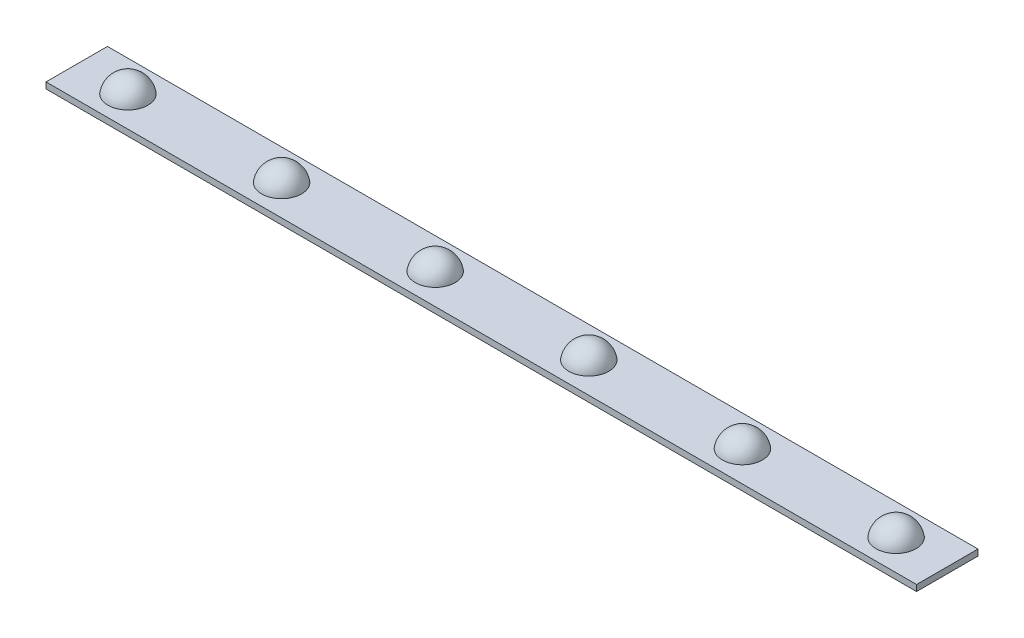
ISO-10303-21;
HEADER;
FILE_DESCRIPTION(('STEP AP214'),'2;1');
FILE_NAME('part.step','',(''),(''),'','','');
FILE_SCHEMA(('AUTOMOTIVE_DESIGN { 1 0 10303 214 1 1 1 1 }'));
ENDSEC;
DATA;
#1=APPLICATION_CONTEXT('core data for automotive mechanical design processes');
#2=APPLICATION_PROTOCOL_DEFINITION('international standard','automotive_design',2000,#1);
#3=PRODUCT_CONTEXT('',#1,'mechanical');
#4=PRODUCT('Part','Part','',(#3));
#5=PRODUCT_RELATED_PRODUCT_CATEGORY('part','',(#4));
#6=PRODUCT_DEFINITION_FORMATION('','',#4);
#7=PRODUCT_DEFINITION_CONTEXT('part definition',#1,'design');
#8=PRODUCT_DEFINITION('design','',#6,#7);
#9=PRODUCT_DEFINITION_SHAPE('','',#8);
#10=(LENGTH_UNIT() NAMED_UNIT(*) SI_UNIT(.MILLI.,.METRE.));
#11=(NAMED_UNIT(*) PLANE_ANGLE_UNIT() SI_UNIT($,.RADIAN.));
#12=(NAMED_UNIT(*) SI_UNIT($,.STERADIAN.) SOLID_ANGLE_UNIT());
#13=UNCERTAINTY_MEASURE_WITH_UNIT(LENGTH_MEASURE(1.E-05),#10,'distance_accuracy_value','');
#14=(GEOMETRIC_REPRESENTATION_CONTEXT(3) GLOBAL_UNCERTAINTY_ASSIGNED_CONTEXT((#13)) GLOBAL_UNIT_ASSIGNED_CONTEXT((#10,
#11,#12)) REPRESENTATION_CONTEXT('',''));
#15=CARTESIAN_POINT('',(0.,0.,0.));
#16=DIRECTION('',(0.,0.,1.));
#17=DIRECTION('',(1.,0.,0.));
#18=AXIS2_PLACEMENT_3D('',#15,#16,#17);
#19=CARTESIAN_POINT('',(-142.113,19.1743717494883,0.152400000000004));
#20=DIRECTION('',(0.,0.,1.));
#21=DIRECTION('',(0.990879797817192,0.134748752416344,0.));
#22=AXIS2_PLACEMENT_3D('',#19,#20,#21);
#23=SPHERICAL_SURFACE('',#22,2.50880067106193);
#24=CARTESIAN_POINT('',(-142.113,19.1743717494883,0.152400000000004));
#25=DIRECTION('',(0.,-1.,0.));
#26=DIRECTION('',(0.,0.,-1.));
#27=AXIS2_PLACEMENT_3D('',#24,#25,#26);
#28=SPHERICAL_SURFACE('',#27,2.50880067106193);
#29=CARTESIAN_POINT('',(-142.113,19.5553717494883,0.152400000000004));
#30=DIRECTION('',(0.,-1.,0.));
#31=DIRECTION('',(0.,0.,-1.));
#32=AXIS2_PLACEMENT_3D('',#29,#30,#31);
#33=CIRCLE('',#32,2.47970155605887);
#34=CARTESIAN_POINT('',(-142.113,19.5553717494883,-2.32730155605887));
#35=VERTEX_POINT('',#34);
#36=EDGE_CURVE('E21',#35,#35,#33,.F.);
#37=ORIENTED_EDGE('',*,*,#36,.T.);
#38=EDGE_LOOP('',(#37));
#39=FACE_BOUND('',#38,.T.);
#40=ADVANCED_FACE('F17',(#39),#28,.T.);
#41=CARTESIAN_POINT('',(-161.163,19.1743717494883,0.152399999999993));
#42=DIRECTION('',(0.,0.,1.));
#43=DIRECTION('',(0.990879797817191,0.134748752416346,0.));
#44=AXIS2_PLACEMENT_3D('',#41,#42,#43);
#45=SPHERICAL_SURFACE('',#44,2.50880067106193);
#46=CARTESIAN_POINT('',(-161.163,19.1743717494883,0.152399999999993));
#47=DIRECTION('',(0.,-1.,0.));
#48=DIRECTION('',(0.,0.,-1.));
#49=AXIS2_PLACEMENT_3D('',#46,#47,#48);
#50=SPHERICAL_SURFACE('',#49,2.50880067106193);
#51=CARTESIAN_POINT('',(-161.163,19.5553717494883,0.152399999999993));
#52=DIRECTION('',(0.,-1.,0.));
#53=DIRECTION('',(0.,0.,-1.));
#54=AXIS2_PLACEMENT_3D('',#51,#52,#53);
#55=CIRCLE('',#54,2.47970155605887);
#56=CARTESIAN_POINT('',(-161.163,19.5553717494883,-2.32730155605888));
#57=VERTEX_POINT('',#56);
#58=EDGE_CURVE('E112',#57,#57,#55,.F.);
#59=ORIENTED_EDGE('',*,*,#58,.T.);
#60=EDGE_LOOP('',(#59));
#61=FACE_BOUND('',#60,.T.);
#62=ADVANCED_FACE('F285',(#61),#50,.T.);
#63=CARTESIAN_POINT('',(-180.213,19.1743717494883,0.152399999999994));
#64=DIRECTION('',(0.,0.,1.));
#65=DIRECTION('',(0.990879797817191,0.134748752416346,0.));
#66=AXIS2_PLACEMENT_3D('',#63,#64,#65);
#67=SPHERICAL_SURFACE('',#66,2.50880067106193);
#68=CARTESIAN_POINT('',(-180.213,19.1743717494883,0.152399999999994));
#69=DIRECTION('',(0.,-1.,0.));
#70=DIRECTION('',(0.,0.,-1.));
#71=AXIS2_PLACEMENT_3D('',#68,#69,#70);
#72=SPHERICAL_SURFACE('',#71,2.50880067106193);
#73=CARTESIAN_POINT('',(-180.213,19.5553717494883,0.152399999999994));
#74=DIRECTION('',(0.,-1.,0.));
#75=DIRECTION('',(0.,0.,-1.));
#76=AXIS2_PLACEMENT_3D('',#73,#74,#75);
#77=CIRCLE('',#76,2.47970155605887);
#78=CARTESIAN_POINT('',(-180.213,19.5553717494883,-2.32730155605888));
#79=VERTEX_POINT('',#78);
#80=EDGE_CURVE('E110',#79,#79,#77,.F.);
#81=ORIENTED_EDGE('',*,*,#80,.T.);
#82=EDGE_LOOP('',(#81));
#83=FACE_BOUND('',#82,.T.);
#84=ADVANCED_FACE('F276',(#83),#72,.T.);
#85=CARTESIAN_POINT('',(-199.263,19.1743717494883,0.15240000000001));
#86=DIRECTION('',(0.,0.,1.));
#87=DIRECTION('',(0.990879797817192,0.134748752416345,0.));
#88=AXIS2_PLACEMENT_3D('',#85,#86,#87);
#89=SPHERICAL_SURFACE('',#88,2.50880067106193);
#90=CARTESIAN_POINT('',(-199.263,19.1743717494883,0.15240000000001));
#91=DIRECTION('',(0.,-1.,0.));
#92=DIRECTION('',(0.,0.,-1.));
#93=AXIS2_PLACEMENT_3D('',#90,#91,#92);
#94=SPHERICAL_SURFACE('',#93,2.50880067106193);
#95=CARTESIAN_POINT('',(-199.263,19.5553717494883,0.15240000000001));
#96=DIRECTION('',(0.,-1.,0.));
#97=DIRECTION('',(0.,0.,-1.));
#98=AXIS2_PLACEMENT_3D('',#95,#96,#97);
#99=CIRCLE('',#98,2.47970155605887);
#100=CARTESIAN_POINT('',(-199.263,19.5553717494883,-2.32730155605886));
#101=VERTEX_POINT('',#100);
#102=EDGE_CURVE('E107',#101,#101,#99,.F.);
#103=ORIENTED_EDGE('',*,*,#102,.T.);
#104=EDGE_LOOP('',(#103));
#105=FACE_BOUND('',#104,.T.);
#106=ADVANCED_FACE('F267',(#105),#94,.T.);
#107=CARTESIAN_POINT('',(-218.313,19.1743717494883,0.15240000000002));
#108=DIRECTION('',(0.,0.,1.));
#109=DIRECTION('',(0.990879797817192,0.134748752416343,0.));
#110=AXIS2_PLACEMENT_3D('',#107,#108,#109);
#111=SPHERICAL_SURFACE('',#110,2.50880067106193);
#112=CARTESIAN_POINT('',(-218.313,19.1743717494883,0.15240000000002));
#113=DIRECTION('',(0.,-1.,0.));
#114=DIRECTION('',(0.,0.,-1.));
#115=AXIS2_PLACEMENT_3D('',#112,#113,#114);
#116=SPHERICAL_SURFACE('',#115,2.50880067106193);
#117=CARTESIAN_POINT('',(-218.313,19.5553717494883,0.15240000000002));
#118=DIRECTION('',(0.,-1.,0.));
#119=DIRECTION('',(0.,0.,-1.));
#120=AXIS2_PLACEMENT_3D('',#117,#118,#119);
#121=CIRCLE('',#120,2.47970155605887);
#122=CARTESIAN_POINT('',(-218.313,19.5553717494883,-2.32730155605885));
#123=VERTEX_POINT('',#122);
#124=EDGE_CURVE('E104',#123,#123,#121,.F.);
#125=ORIENTED_EDGE('',*,*,#124,.T.);
#126=EDGE_LOOP('',(#125));
#127=FACE_BOUND('',#126,.T.);
#128=ADVANCED_FACE('F132',(#127),#116,.T.);
#129=CARTESIAN_POINT('',(-237.363,19.1743717494883,0.152399999999986));
#130=DIRECTION('',(0.,0.,1.));
#131=DIRECTION('',(0.990879797817192,0.134748752416344,0.));
#132=AXIS2_PLACEMENT_3D('',#129,#130,#131);
#133=SPHERICAL_SURFACE('',#132,2.50880067106193);
#134=CARTESIAN_POINT('',(-237.363,19.1743717494883,0.152399999999986));
#135=DIRECTION('',(0.,-1.,0.));
#136=DIRECTION('',(0.,0.,-1.));
#137=AXIS2_PLACEMENT_3D('',#134,#135,#136);
#138=SPHERICAL_SURFACE('',#137,2.50880067106193);
#139=CARTESIAN_POINT('',(-237.363,19.5553717494883,0.152399999999986));
#140=DIRECTION('',(0.,-1.,0.));
#141=DIRECTION('',(0.,0.,-1.));
#142=AXIS2_PLACEMENT_3D('',#139,#140,#141);
#143=CIRCLE('',#142,2.47970155605887);
#144=CARTESIAN_POINT('',(-237.363,19.5553717494883,-2.32730155605888));
#145=VERTEX_POINT('',#144);
#146=EDGE_CURVE('E68',#145,#145,#143,.F.);
#147=ORIENTED_EDGE('',*,*,#146,.T.);
#148=EDGE_LOOP('',(#147));
#149=FACE_BOUND('',#148,.T.);
#150=ADVANCED_FACE('F122',(#149),#138,.T.);
#151=CARTESIAN_POINT('',(-243.713,19.5553717494883,3.9624));
#152=DIRECTION('',(0.,-1.,0.));
#153=DIRECTION('',(0.,0.,-1.));
#154=AXIS2_PLACEMENT_3D('',#151,#152,#153);
#155=PLANE('',#154);
#156=DIRECTION('',(1.,0.,0.));
#157=VECTOR('',#156,1.);
#158=CARTESIAN_POINT('',(0.,19.5553717494883,-3.6576));
#159=LINE('',#158,#157);
#160=CARTESIAN_POINT('',(-135.763,19.5553717494883,-3.6576));
#161=VERTEX_POINT('',#160);
#162=CARTESIAN_POINT('',(-243.713,19.5553717494883,-3.6576));
#163=VERTEX_POINT('',#162);
#164=EDGE_CURVE('E316',#161,#163,#159,.F.);
#165=ORIENTED_EDGE('',*,*,#164,.T.);
#166=DIRECTION('',(0.,0.,-1.));
#167=VECTOR('',#166,1.);
#168=CARTESIAN_POINT('',(-243.713,19.5553717494883,0.));
#169=LINE('',#168,#167);
#170=CARTESIAN_POINT('',(-243.713,19.5553717494883,3.96240000000001));
#171=VERTEX_POINT('',#170);
#172=EDGE_CURVE('E62',#163,#171,#169,.F.);
#173=ORIENTED_EDGE('',*,*,#172,.T.);
#174=DIRECTION('',(-1.,0.,0.));
#175=VECTOR('',#174,1.);
#176=CARTESIAN_POINT('',(0.,19.5553717494883,3.96240000000002));
#177=LINE('',#176,#175);
#178=CARTESIAN_POINT('',(-135.763,19.5553717494883,3.96240000000001));
#179=VERTEX_POINT('',#178);
#180=EDGE_CURVE('E59',#171,#179,#177,.F.);
#181=ORIENTED_EDGE('',*,*,#180,.T.);
#182=DIRECTION('',(0.,0.,1.));
#183=VECTOR('',#182,1.);
#184=CARTESIAN_POINT('',(-135.763,19.5553717494883,0.));
#185=LINE('',#184,#183);
#186=EDGE_CURVE('E56',#179,#161,#185,.F.);
#187=ORIENTED_EDGE('',*,*,#186,.T.);
#188=EDGE_LOOP('',(#165,#173,#181,#187));
#189=FACE_BOUND('',#188,.T.);
#190=ORIENTED_EDGE('',*,*,#146,.F.);
#191=EDGE_LOOP('',(#190));
#192=FACE_BOUND('',#191,.T.);
#193=ORIENTED_EDGE('',*,*,#124,.F.);
#194=EDGE_LOOP('',(#193));
#195=FACE_BOUND('',#194,.T.);
#196=ORIENTED_EDGE('',*,*,#102,.F.);
#197=EDGE_LOOP('',(#196));
#198=FACE_BOUND('',#197,.T.);
#199=ORIENTED_EDGE('',*,*,#80,.F.);
#200=EDGE_LOOP('',(#199));
#201=FACE_BOUND('',#200,.T.);
#202=ORIENTED_EDGE('',*,*,#58,.F.);
#203=EDGE_LOOP('',(#202));
#204=FACE_BOUND('',#203,.T.);
#205=ORIENTED_EDGE('',*,*,#36,.F.);
#206=EDGE_LOOP('',(#205));
#207=FACE_BOUND('',#206,.T.);
#208=ADVANCED_FACE('F60',(#189,#192,#195,#198,#201,#204,#207),#155,.F.);
#209=CARTESIAN_POINT('',(-237.363,19.1743717494883,0.152400000000015));
#210=DIRECTION('',(0.,0.,1.));
#211=DIRECTION('',(-0.989696979871631,-0.143177819626411,0.));
#212=AXIS2_PLACEMENT_3D('',#209,#210,#211);
#213=SPHERICAL_SURFACE('',#212,2.50880067106193);
#214=CARTESIAN_POINT('',(-237.363,19.1743717494883,0.152400000000015));
#215=DIRECTION('',(0.,1.,0.));
#216=DIRECTION('',(0.,0.,1.));
#217=AXIS2_PLACEMENT_3D('',#214,#215,#216);
#218=SPHERICAL_SURFACE('',#217,2.50880067106193);
#219=CARTESIAN_POINT('',(-237.363,18.7933717494883,0.152399999999994));
#220=DIRECTION('',(0.,1.,0.));
#221=DIRECTION('',(0.,0.,1.));
#222=AXIS2_PLACEMENT_3D('',#219,#220,#221);
#223=CIRCLE('',#222,2.47970155605887);
#224=CARTESIAN_POINT('',(-237.363,18.7933717494883,2.63210155605887));
#225=VERTEX_POINT('',#224);
#226=EDGE_CURVE('E98',#225,#225,#223,.F.);
#227=ORIENTED_EDGE('',*,*,#226,.T.);
#228=EDGE_LOOP('',(#227));
#229=FACE_BOUND('',#228,.T.);
#230=ADVANCED_FACE('F121',(#229),#218,.T.);
#231=CARTESIAN_POINT('',(-218.313,19.1743717494883,0.152399999999994));
#232=DIRECTION('',(0.,0.,1.));
#233=DIRECTION('',(0.,-1.,0.));
#234=AXIS2_PLACEMENT_3D('',#231,#232,#233);
#235=SPHERICAL_SURFACE('',#234,2.50880067106193);
#236=CARTESIAN_POINT('',(-218.313,19.1743717494883,0.152399999999994));
#237=DIRECTION('',(0.,1.,0.));
#238=DIRECTION('',(0.,0.,1.));
#239=AXIS2_PLACEMENT_3D('',#236,#237,#238);
#240=SPHERICAL_SURFACE('',#239,2.50880067106193);
#241=CARTESIAN_POINT('',(-218.313,18.7933717494883,0.152400000000023));
#242=DIRECTION('',(0.,1.,0.));
#243=DIRECTION('',(0.,0.,1.));
#244=AXIS2_PLACEMENT_3D('',#241,#242,#243);
#245=CIRCLE('',#244,2.47970155605887);
#246=CARTESIAN_POINT('',(-218.313,18.7933717494883,2.6321015560589));
#247=VERTEX_POINT('',#246);
#248=EDGE_CURVE('E95',#247,#247,#245,.F.);
#249=ORIENTED_EDGE('',*,*,#248,.T.);
#250=EDGE_LOOP('',(#249));
#251=FACE_BOUND('',#250,.T.);
#252=ADVANCED_FACE('F129',(#251),#240,.T.);
#253=CARTESIAN_POINT('',(-199.263,19.1743717494883,0.152399999999994));
#254=DIRECTION('',(0.,0.,1.));
#255=DIRECTION('',(0.,-1.,0.));
#256=AXIS2_PLACEMENT_3D('',#253,#254,#255);
#257=SPHERICAL_SURFACE('',#256,2.50880067106193);
#258=CARTESIAN_POINT('',(-199.263,19.1743717494883,0.152399999999994));
#259=DIRECTION('',(0.,1.,0.));
#260=DIRECTION('',(0.,0.,1.));
#261=AXIS2_PLACEMENT_3D('',#258,#259,#260);
#262=SPHERICAL_SURFACE('',#261,2.50880067106193);
#263=CARTESIAN_POINT('',(-199.263,18.7933717494883,0.15240000000001));
#264=DIRECTION('',(0.,1.,0.));
#265=DIRECTION('',(0.,0.,1.));
#266=AXIS2_PLACEMENT_3D('',#263,#264,#265);
#267=CIRCLE('',#266,2.47970155605887);
#268=CARTESIAN_POINT('',(-199.263,18.7933717494883,2.63210155605888));
#269=VERTEX_POINT('',#268);
#270=EDGE_CURVE('E92',#269,#269,#267,.F.);
#271=ORIENTED_EDGE('',*,*,#270,.T.);
#272=EDGE_LOOP('',(#271));
#273=FACE_BOUND('',#272,.T.);
#274=ADVANCED_FACE('F178',(#273),#262,.T.);
#275=CARTESIAN_POINT('',(-180.213,19.1743717494883,0.152399999999994));
#276=DIRECTION('',(0.,0.,1.));
#277=DIRECTION('',(0.,-1.,0.));
#278=AXIS2_PLACEMENT_3D('',#275,#276,#277);
#279=SPHERICAL_SURFACE('',#278,2.50880067106193);
#280=CARTESIAN_POINT('',(-180.213,19.1743717494883,0.152399999999994));
#281=DIRECTION('',(0.,1.,0.));
#282=DIRECTION('',(0.,0.,1.));
#283=AXIS2_PLACEMENT_3D('',#280,#281,#282);
#284=SPHERICAL_SURFACE('',#283,2.50880067106193);
#285=CARTESIAN_POINT('',(-180.213,18.7933717494883,0.152400000000008));
#286=DIRECTION('',(0.,1.,0.));
#287=DIRECTION('',(0.,0.,1.));
#288=AXIS2_PLACEMENT_3D('',#285,#286,#287);
#289=CIRCLE('',#288,2.47970155605887);
#290=CARTESIAN_POINT('',(-180.213,18.7933717494883,2.63210155605888));
#291=VERTEX_POINT('',#290);
#292=EDGE_CURVE('E89',#291,#291,#289,.F.);
#293=ORIENTED_EDGE('',*,*,#292,.T.);
#294=EDGE_LOOP('',(#293));
#295=FACE_BOUND('',#294,.T.);
#296=ADVANCED_FACE('F163',(#295),#284,.T.);
#297=CARTESIAN_POINT('',(-161.163,19.1743717494883,0.152399999999994));
#298=DIRECTION('',(0.,0.,1.));
#299=DIRECTION('',(0.,-1.,0.));
#300=AXIS2_PLACEMENT_3D('',#297,#298,#299);
#301=SPHERICAL_SURFACE('',#300,2.50880067106193);
#302=CARTESIAN_POINT('',(-161.163,19.1743717494883,0.152399999999994));
#303=DIRECTION('',(0.,1.,0.));
#304=DIRECTION('',(0.,0.,1.));
#305=AXIS2_PLACEMENT_3D('',#302,#303,#304);
#306=SPHERICAL_SURFACE('',#305,2.50880067106193);
#307=CARTESIAN_POINT('',(-161.163,18.7933717494883,0.152399999999999));
#308=DIRECTION('',(0.,1.,0.));
#309=DIRECTION('',(0.,0.,1.));
#310=AXIS2_PLACEMENT_3D('',#307,#308,#309);
#311=CIRCLE('',#310,2.47970155605887);
#312=CARTESIAN_POINT('',(-161.163,18.7933717494883,2.63210155605887));
#313=VERTEX_POINT('',#312);
#314=EDGE_CURVE('E86',#313,#313,#311,.F.);
#315=ORIENTED_EDGE('',*,*,#314,.T.);
#316=EDGE_LOOP('',(#315));
#317=FACE_BOUND('',#316,.T.);
#318=ADVANCED_FACE('F158',(#317),#306,.T.);
#319=CARTESIAN_POINT('',(-142.113,19.1743717494883,0.152399999999994));
#320=DIRECTION('',(0.,0.,1.));
#321=DIRECTION('',(0.,-1.,0.));
#322=AXIS2_PLACEMENT_3D('',#319,#320,#321);
#323=SPHERICAL_SURFACE('',#322,2.50880067106193);
#324=CARTESIAN_POINT('',(-142.113,19.1743717494883,0.152399999999994));
#325=DIRECTION('',(0.,1.,0.));
#326=DIRECTION('',(0.,0.,1.));
#327=AXIS2_PLACEMENT_3D('',#324,#325,#326);
#328=SPHERICAL_SURFACE('',#327,2.50880067106193);
#329=CARTESIAN_POINT('',(-142.113,18.7933717494883,0.152399999999999));
#330=DIRECTION('',(0.,1.,0.));
#331=DIRECTION('',(0.,0.,1.));
#332=AXIS2_PLACEMENT_3D('',#329,#330,#331);
#333=CIRCLE('',#332,2.47970155605887);
#334=CARTESIAN_POINT('',(-142.113,18.7933717494883,2.63210155605887));
#335=VERTEX_POINT('',#334);
#336=EDGE_CURVE('E83',#335,#335,#333,.F.);
#337=ORIENTED_EDGE('',*,*,#336,.T.);
#338=EDGE_LOOP('',(#337));
#339=FACE_BOUND('',#338,.T.);
#340=ADVANCED_FACE('F19',(#339),#328,.T.);
#341=CARTESIAN_POINT('',(0.,0.,3.96240000000002));
#342=DIRECTION('',(0.,0.,-1.));
#343=DIRECTION('',(-1.,0.,0.));
#344=AXIS2_PLACEMENT_3D('',#341,#342,#343);
#345=PLANE('',#344);
#346=DIRECTION('',(0.,1.,0.));
#347=VECTOR('',#346,1.);
#348=CARTESIAN_POINT('',(-135.763,0.,3.9624));
#349=LINE('',#348,#347);
#350=CARTESIAN_POINT('',(-135.763,18.7933717494883,3.96240000000001));
#351=VERTEX_POINT('',#350);
#352=EDGE_CURVE('E67',#351,#179,#349,.T.);
#353=ORIENTED_EDGE('',*,*,#352,.T.);
#354=ORIENTED_EDGE('',*,*,#180,.F.);
#355=DIRECTION('',(0.,1.,0.));
#356=VECTOR('',#355,1.);
#357=CARTESIAN_POINT('',(-243.713,0.,3.9624));
#358=LINE('',#357,#356);
#359=CARTESIAN_POINT('',(-243.713,18.7933717494883,3.96240000000001));
#360=VERTEX_POINT('',#359);
#361=EDGE_CURVE('E101',#171,#360,#358,.F.);
#362=ORIENTED_EDGE('',*,*,#361,.T.);
#363=DIRECTION('',(1.,0.,0.));
#364=VECTOR('',#363,1.);
#365=CARTESIAN_POINT('',(-243.713,18.7933717494883,3.9624));
#366=LINE('',#365,#364);
#367=EDGE_CURVE('E79',#360,#351,#366,.T.);
#368=ORIENTED_EDGE('',*,*,#367,.T.);
#369=EDGE_LOOP('',(#353,#354,#362,#368));
#370=FACE_BOUND('',#369,.T.);
#371=ADVANCED_FACE('F78',(#370),#345,.F.);
#372=CARTESIAN_POINT('',(-135.763,0.,0.));
#373=DIRECTION('',(-1.,0.,0.));
#374=DIRECTION('',(0.,0.,1.));
#375=AXIS2_PLACEMENT_3D('',#372,#373,#374);
#376=PLANE('',#375);
#377=DIRECTION('',(0.,1.,0.));
#378=VECTOR('',#377,1.);
#379=CARTESIAN_POINT('',(-135.763,0.,-3.6576));
#380=LINE('',#379,#378);
#381=CARTESIAN_POINT('',(-135.763,18.7933717494883,-3.6576));
#382=VERTEX_POINT('',#381);
#383=EDGE_CURVE('E75',#382,#161,#380,.T.);
#384=ORIENTED_EDGE('',*,*,#383,.T.);
#385=ORIENTED_EDGE('',*,*,#186,.F.);
#386=ORIENTED_EDGE('',*,*,#352,.F.);
#387=DIRECTION('',(0.,0.,1.));
#388=VECTOR('',#387,1.);
#389=CARTESIAN_POINT('',(-135.763,18.7933717494883,3.9624));
#390=LINE('',#389,#388);
#391=EDGE_CURVE('E323',#351,#382,#390,.F.);
#392=ORIENTED_EDGE('',*,*,#391,.T.);
#393=EDGE_LOOP('',(#384,#385,#386,#392));
#394=FACE_BOUND('',#393,.T.);
#395=ADVANCED_FACE('F72',(#394),#376,.F.);
#396=CARTESIAN_POINT('',(0.,0.,-3.6576));
#397=DIRECTION('',(0.,0.,1.));
#398=DIRECTION('',(1.,0.,0.));
#399=AXIS2_PLACEMENT_3D('',#396,#397,#398);
#400=PLANE('',#399);
#401=DIRECTION('',(0.,1.,0.));
#402=VECTOR('',#401,1.);
#403=CARTESIAN_POINT('',(-243.713,0.,-3.6576));
#404=LINE('',#403,#402);
#405=CARTESIAN_POINT('',(-243.713,18.7933717494883,-3.6576));
#406=VERTEX_POINT('',#405);
#407=EDGE_CURVE('E35',#406,#163,#404,.T.);
#408=ORIENTED_EDGE('',*,*,#407,.T.);
#409=ORIENTED_EDGE('',*,*,#164,.F.);
#410=ORIENTED_EDGE('',*,*,#383,.F.);
#411=DIRECTION('',(1.,0.,0.));
#412=VECTOR('',#411,1.);
#413=CARTESIAN_POINT('',(-243.713,18.7933717494883,-3.6576));
#414=LINE('',#413,#412);
#415=EDGE_CURVE('E27',#382,#406,#414,.F.);
#416=ORIENTED_EDGE('',*,*,#415,.T.);
#417=EDGE_LOOP('',(#408,#409,#410,#416));
#418=FACE_BOUND('',#417,.T.);
#419=ADVANCED_FACE('F145',(#418),#400,.F.);
#420=CARTESIAN_POINT('',(-243.713,0.,0.));
#421=DIRECTION('',(1.,0.,0.));
#422=DIRECTION('',(0.,0.,-1.));
#423=AXIS2_PLACEMENT_3D('',#420,#421,#422);
#424=PLANE('',#423);
#425=ORIENTED_EDGE('',*,*,#361,.F.);
#426=ORIENTED_EDGE('',*,*,#172,.F.);
#427=ORIENTED_EDGE('',*,*,#407,.F.);
#428=DIRECTION('',(0.,0.,1.));
#429=VECTOR('',#428,1.);
#430=CARTESIAN_POINT('',(-243.713,18.7933717494883,3.9624));
#431=LINE('',#430,#429);
#432=EDGE_CURVE('E11',#406,#360,#431,.T.);
#433=ORIENTED_EDGE('',*,*,#432,.T.);
#434=EDGE_LOOP('',(#425,#426,#427,#433));
#435=FACE_BOUND('',#434,.T.);
#436=ADVANCED_FACE('F139',(#435),#424,.F.);
#437=CARTESIAN_POINT('',(-243.713,18.7933717494883,3.9624));
#438=DIRECTION('',(0.,1.,0.));
#439=DIRECTION('',(0.,0.,1.));
#440=AXIS2_PLACEMENT_3D('',#437,#438,#439);
#441=PLANE('',#440);
#442=ORIENTED_EDGE('',*,*,#415,.F.);
#443=ORIENTED_EDGE('',*,*,#391,.F.);
#444=ORIENTED_EDGE('',*,*,#367,.F.);
#445=ORIENTED_EDGE('',*,*,#432,.F.);
#446=EDGE_LOOP('',(#442,#443,#444,#445));
#447=FACE_BOUND('',#446,.T.);
#448=ORIENTED_EDGE('',*,*,#336,.F.);
#449=EDGE_LOOP('',(#448));
#450=FACE_BOUND('',#449,.T.);
#451=ORIENTED_EDGE('',*,*,#314,.F.);
#452=EDGE_LOOP('',(#451));
#453=FACE_BOUND('',#452,.T.);
#454=ORIENTED_EDGE('',*,*,#292,.F.);
#455=EDGE_LOOP('',(#454));
#456=FACE_BOUND('',#455,.T.);
#457=ORIENTED_EDGE('',*,*,#270,.F.);
#458=EDGE_LOOP('',(#457));
#459=FACE_BOUND('',#458,.T.);
#460=ORIENTED_EDGE('',*,*,#248,.F.);
#461=EDGE_LOOP('',(#460));
#462=FACE_BOUND('',#461,.T.);
#463=ORIENTED_EDGE('',*,*,#226,.F.);
#464=EDGE_LOOP('',(#463));
#465=FACE_BOUND('',#464,.T.);
#466=ADVANCED_FACE('F137',(#447,#450,#453,#456,#459,#462,#465),#441,.F.);
#467=CLOSED_SHELL('',(#40,#62,#84,#106,#128,#150,#208,#230,#252,#274,#296,#318,#340,#371,#395,
#419,#436,#466));
#468=MANIFOLD_SOLID_BREP('B1',#467);
#469=ADVANCED_BREP_SHAPE_REPRESENTATION('',(#18,#468),#14);
#470=SHAPE_DEFINITION_REPRESENTATION(#9,#469);
ENDSEC;
END-ISO-10303-21;
